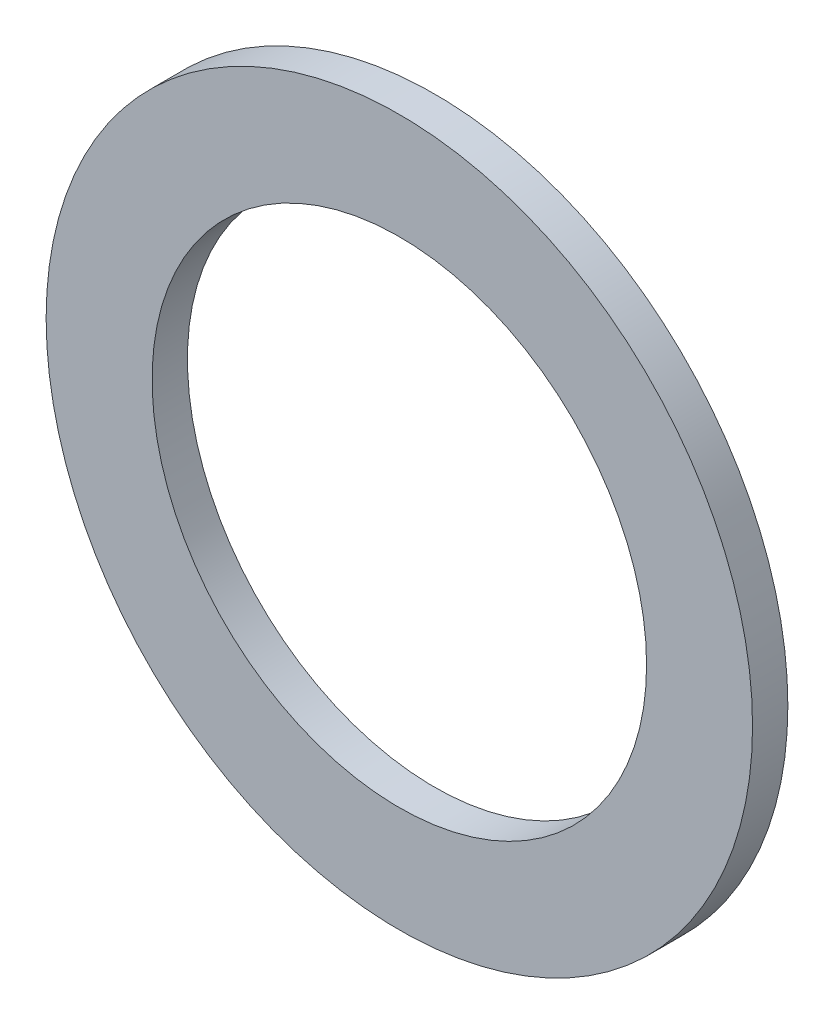
ISO-10303-21;
HEADER;
FILE_DESCRIPTION(('STEP AP214'),'2;1');
FILE_NAME('part.step','',(''),(''),'','','');
FILE_SCHEMA(('AUTOMOTIVE_DESIGN { 1 0 10303 214 1 1 1 1 }'));
ENDSEC;
DATA;
#1=APPLICATION_CONTEXT('core data for automotive mechanical design processes');
#2=APPLICATION_PROTOCOL_DEFINITION('international standard','automotive_design',2000,#1);
#3=PRODUCT_CONTEXT('',#1,'mechanical');
#4=PRODUCT('Part','Part','',(#3));
#5=PRODUCT_RELATED_PRODUCT_CATEGORY('part','',(#4));
#6=PRODUCT_DEFINITION_FORMATION('','',#4);
#7=PRODUCT_DEFINITION_CONTEXT('part definition',#1,'design');
#8=PRODUCT_DEFINITION('design','',#6,#7);
#9=PRODUCT_DEFINITION_SHAPE('','',#8);
#10=(LENGTH_UNIT() NAMED_UNIT(*) SI_UNIT(.MILLI.,.METRE.));
#11=(NAMED_UNIT(*) PLANE_ANGLE_UNIT() SI_UNIT($,.RADIAN.));
#12=(NAMED_UNIT(*) SI_UNIT($,.STERADIAN.) SOLID_ANGLE_UNIT());
#13=UNCERTAINTY_MEASURE_WITH_UNIT(LENGTH_MEASURE(1.E-05),#10,'distance_accuracy_value','');
#14=(GEOMETRIC_REPRESENTATION_CONTEXT(3) GLOBAL_UNCERTAINTY_ASSIGNED_CONTEXT((#13)) GLOBAL_UNIT_ASSIGNED_CONTEXT((#10,
#11,#12)) REPRESENTATION_CONTEXT('',''));
#15=CARTESIAN_POINT('',(0.,0.,0.));
#16=DIRECTION('',(0.,0.,1.));
#17=DIRECTION('',(1.,0.,0.));
#18=AXIS2_PLACEMENT_3D('',#15,#16,#17);
#19=CARTESIAN_POINT('',(0.,0.,3.175));
#20=DIRECTION('',(0.,0.,1.));
#21=DIRECTION('',(1.,0.,0.));
#22=AXIS2_PLACEMENT_3D('',#19,#20,#21);
#23=PLANE('',#22);
#24=CARTESIAN_POINT('',(0.,0.,3.175));
#25=DIRECTION('',(0.,0.,1.));
#26=DIRECTION('',(1.,0.,0.));
#27=AXIS2_PLACEMENT_3D('',#24,#25,#26);
#28=CIRCLE('',#27,31.75);
#29=CARTESIAN_POINT('',(31.75,0.,3.175));
#30=VERTEX_POINT('',#29);
#31=EDGE_CURVE('E10',#30,#30,#28,.T.);
#32=ORIENTED_EDGE('',*,*,#31,.T.);
#33=EDGE_LOOP('',(#32));
#34=FACE_BOUND('',#33,.T.);
#35=CARTESIAN_POINT('',(0.,0.,3.175));
#36=DIRECTION('',(0.,0.,1.));
#37=DIRECTION('',(1.,0.,0.));
#38=AXIS2_PLACEMENT_3D('',#35,#36,#37);
#39=CIRCLE('',#38,22.225);
#40=CARTESIAN_POINT('',(22.225,0.,3.175));
#41=VERTEX_POINT('',#40);
#42=EDGE_CURVE('E46',#41,#41,#39,.T.);
#43=ORIENTED_EDGE('',*,*,#42,.F.);
#44=EDGE_LOOP('',(#43));
#45=FACE_BOUND('',#44,.T.);
#46=ADVANCED_FACE('F35',(#34,#45),#23,.T.);
#47=CARTESIAN_POINT('',(0.,0.,0.));
#48=DIRECTION('',(0.,0.,1.));
#49=DIRECTION('',(1.,0.,0.));
#50=AXIS2_PLACEMENT_3D('',#47,#48,#49);
#51=PLANE('',#50);
#52=CARTESIAN_POINT('',(0.,0.,0.));
#53=DIRECTION('',(0.,0.,1.));
#54=DIRECTION('',(1.,0.,0.));
#55=AXIS2_PLACEMENT_3D('',#52,#53,#54);
#56=CIRCLE('',#55,31.75);
#57=CARTESIAN_POINT('',(31.75,0.,0.));
#58=VERTEX_POINT('',#57);
#59=EDGE_CURVE('E39',#58,#58,#56,.T.);
#60=ORIENTED_EDGE('',*,*,#59,.F.);
#61=EDGE_LOOP('',(#60));
#62=FACE_BOUND('',#61,.T.);
#63=CARTESIAN_POINT('',(0.,0.,0.));
#64=DIRECTION('',(0.,0.,1.));
#65=DIRECTION('',(1.,0.,0.));
#66=AXIS2_PLACEMENT_3D('',#63,#64,#65);
#67=CIRCLE('',#66,22.225);
#68=CARTESIAN_POINT('',(22.225,0.,0.));
#69=VERTEX_POINT('',#68);
#70=EDGE_CURVE('E48',#69,#69,#67,.T.);
#71=ORIENTED_EDGE('',*,*,#70,.T.);
#72=EDGE_LOOP('',(#71));
#73=FACE_BOUND('',#72,.T.);
#74=ADVANCED_FACE('F58',(#62,#73),#51,.F.);
#75=CARTESIAN_POINT('',(0.,0.,3.175));
#76=DIRECTION('',(0.,0.,-1.));
#77=DIRECTION('',(-1.,0.,0.));
#78=AXIS2_PLACEMENT_3D('',#75,#76,#77);
#79=CYLINDRICAL_SURFACE('',#78,31.75);
#80=ORIENTED_EDGE('',*,*,#31,.F.);
#81=EDGE_LOOP('',(#80));
#82=FACE_BOUND('',#81,.T.);
#83=ORIENTED_EDGE('',*,*,#59,.T.);
#84=EDGE_LOOP('',(#83));
#85=FACE_BOUND('',#84,.T.);
#86=ADVANCED_FACE('F37',(#82,#85),#79,.T.);
#87=CARTESIAN_POINT('',(0.,0.,3.175));
#88=DIRECTION('',(0.,0.,-1.));
#89=DIRECTION('',(-1.,0.,0.));
#90=AXIS2_PLACEMENT_3D('',#87,#88,#89);
#91=CYLINDRICAL_SURFACE('',#90,22.225);
#92=ORIENTED_EDGE('',*,*,#42,.T.);
#93=EDGE_LOOP('',(#92));
#94=FACE_BOUND('',#93,.T.);
#95=ORIENTED_EDGE('',*,*,#70,.F.);
#96=EDGE_LOOP('',(#95));
#97=FACE_BOUND('',#96,.T.);
#98=ADVANCED_FACE('F54',(#94,#97),#91,.F.);
#99=CLOSED_SHELL('',(#46,#74,#86,#98));
#100=MANIFOLD_SOLID_BREP('B2',#99);
#101=ADVANCED_BREP_SHAPE_REPRESENTATION('',(#18,#100),#14);
#102=SHAPE_DEFINITION_REPRESENTATION(#9,#101);
ENDSEC;
END-ISO-10303-21;
